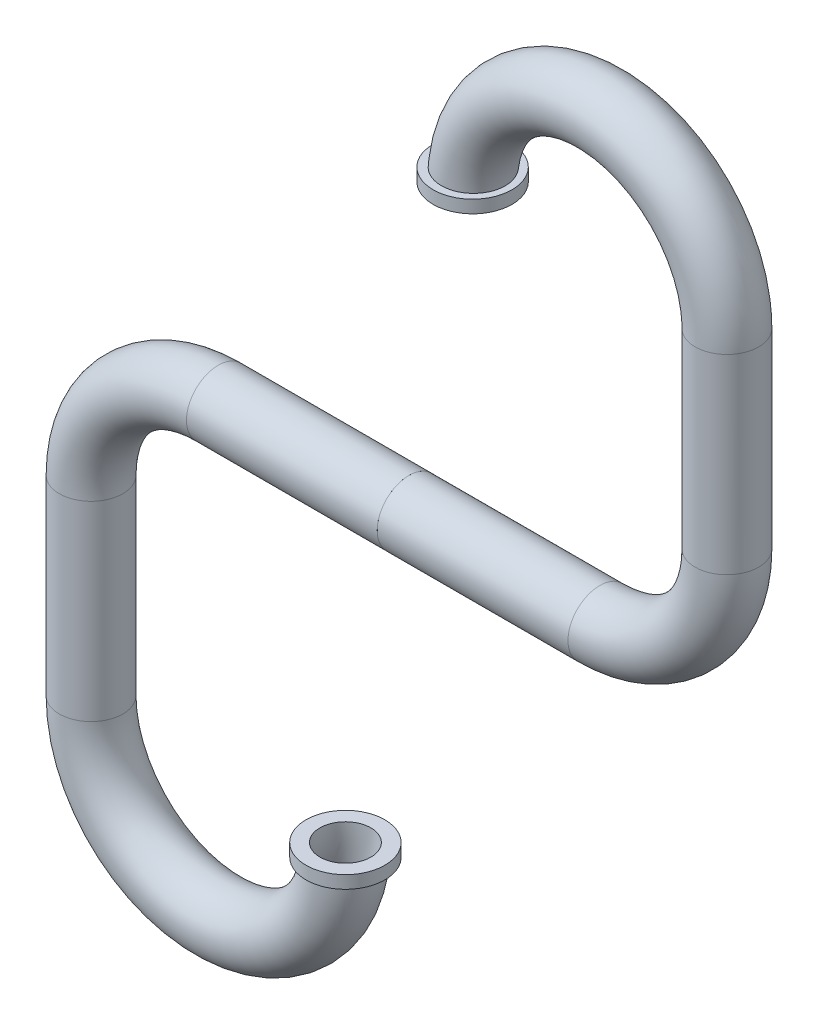
ISO-10303-21;
HEADER;
FILE_DESCRIPTION(('STEP AP214'),'2;1');
FILE_NAME('part.step','',(''),(''),'','','');
FILE_SCHEMA(('AUTOMOTIVE_DESIGN { 1 0 10303 214 1 1 1 1 }'));
ENDSEC;
DATA;
#1=APPLICATION_CONTEXT('core data for automotive mechanical design processes');
#2=APPLICATION_PROTOCOL_DEFINITION('international standard','automotive_design',2000,#1);
#3=PRODUCT_CONTEXT('',#1,'mechanical');
#4=PRODUCT('Part','Part','',(#3));
#5=PRODUCT_RELATED_PRODUCT_CATEGORY('part','',(#4));
#6=PRODUCT_DEFINITION_FORMATION('','',#4);
#7=PRODUCT_DEFINITION_CONTEXT('part definition',#1,'design');
#8=PRODUCT_DEFINITION('design','',#6,#7);
#9=PRODUCT_DEFINITION_SHAPE('','',#8);
#10=(LENGTH_UNIT() NAMED_UNIT(*) SI_UNIT(.MILLI.,.METRE.));
#11=(NAMED_UNIT(*) PLANE_ANGLE_UNIT() SI_UNIT($,.RADIAN.));
#12=(NAMED_UNIT(*) SI_UNIT($,.STERADIAN.) SOLID_ANGLE_UNIT());
#13=UNCERTAINTY_MEASURE_WITH_UNIT(LENGTH_MEASURE(1.E-05),#10,'distance_accuracy_value','');
#14=(GEOMETRIC_REPRESENTATION_CONTEXT(3) GLOBAL_UNCERTAINTY_ASSIGNED_CONTEXT((#13)) GLOBAL_UNIT_ASSIGNED_CONTEXT((#10,
#11,#12)) REPRESENTATION_CONTEXT('',''));
#15=CARTESIAN_POINT('',(0.,0.,0.));
#16=DIRECTION('',(0.,0.,1.));
#17=DIRECTION('',(1.,0.,0.));
#18=AXIS2_PLACEMENT_3D('',#15,#16,#17);
#19=CARTESIAN_POINT('',(0.5,-5.,0.));
#20=DIRECTION('',(1.,0.,0.));
#21=DIRECTION('',(0.,0.,1.));
#22=AXIS2_PLACEMENT_3D('',#19,#20,#21);
#23=PLANE('',#22);
#24=CARTESIAN_POINT('',(0.5,-2.5,0.));
#25=DIRECTION('',(1.,0.,0.));
#26=DIRECTION('',(0.,0.,1.));
#27=AXIS2_PLACEMENT_3D('',#24,#25,#26);
#28=CIRCLE('',#27,0.2);
#29=CARTESIAN_POINT('',(0.5,-2.5,0.2));
#30=VERTEX_POINT('',#29);
#31=EDGE_CURVE('E44',#30,#30,#28,.F.);
#32=ORIENTED_EDGE('',*,*,#31,.T.);
#33=EDGE_LOOP('',(#32));
#34=FACE_BOUND('',#33,.T.);
#35=CARTESIAN_POINT('',(0.5,-2.5,0.));
#36=DIRECTION('',(1.,0.,0.));
#37=DIRECTION('',(0.,0.,1.));
#38=AXIS2_PLACEMENT_3D('',#35,#36,#37);
#39=CIRCLE('',#38,0.25);
#40=CARTESIAN_POINT('',(0.5,-2.5,0.25));
#41=VERTEX_POINT('',#40);
#42=EDGE_CURVE('E58',#41,#41,#39,.F.);
#43=ORIENTED_EDGE('',*,*,#42,.F.);
#44=EDGE_LOOP('',(#43));
#45=FACE_BOUND('',#44,.T.);
#46=ADVANCED_FACE('F40',(#34,#45),#23,.T.);
#47=CARTESIAN_POINT('',(0.,-5.1,0.));
#48=DIRECTION('',(0.,1.,0.));
#49=DIRECTION('',(0.,0.,1.));
#50=AXIS2_PLACEMENT_3D('',#47,#48,#49);
#51=CYLINDRICAL_SURFACE('',#50,0.31);
#52=CARTESIAN_POINT('',(0.,-5.1,0.));
#53=DIRECTION('',(0.,-1.,0.));
#54=DIRECTION('',(0.,0.,-1.));
#55=AXIS2_PLACEMENT_3D('',#52,#53,#54);
#56=CIRCLE('',#55,0.31);
#57=CARTESIAN_POINT('',(0.,-5.1,-0.310000000000018));
#58=VERTEX_POINT('',#57);
#59=EDGE_CURVE('E48',#58,#58,#56,.T.);
#60=ORIENTED_EDGE('',*,*,#59,.F.);
#61=EDGE_LOOP('',(#60));
#62=FACE_BOUND('',#61,.T.);
#63=CARTESIAN_POINT('',(0.,-5.,0.));
#64=DIRECTION('',(0.,-1.,0.));
#65=DIRECTION('',(0.,0.,-1.));
#66=AXIS2_PLACEMENT_3D('',#63,#64,#65);
#67=CIRCLE('',#66,0.31);
#68=CARTESIAN_POINT('',(0.,-5.,-0.310000000000017));
#69=VERTEX_POINT('',#68);
#70=EDGE_CURVE('E11',#69,#69,#67,.T.);
#71=ORIENTED_EDGE('',*,*,#70,.T.);
#72=EDGE_LOOP('',(#71));
#73=FACE_BOUND('',#72,.T.);
#74=ADVANCED_FACE('F84',(#62,#73),#51,.T.);
#75=CARTESIAN_POINT('',(0.,-5.1,0.));
#76=DIRECTION('',(0.,-1.,0.));
#77=DIRECTION('',(0.,0.,-1.));
#78=AXIS2_PLACEMENT_3D('',#75,#76,#77);
#79=PLANE('',#78);
#80=ORIENTED_EDGE('',*,*,#59,.T.);
#81=EDGE_LOOP('',(#80));
#82=FACE_BOUND('',#81,.T.);
#83=CARTESIAN_POINT('',(-0.201401096317609,-5.1,0.156239637939037));
#84=CARTESIAN_POINT('',(-0.210190615714738,-5.1,0.145344468335591));
#85=CARTESIAN_POINT('',(-0.218071722109463,-5.1,0.133703962300563));
#86=CARTESIAN_POINT('',(-0.231777903107573,-5.1,0.10925737914307));
#87=CARTESIAN_POINT('',(-0.237600690405998,-5.1,0.0964500251078168));
#88=CARTESIAN_POINT('',(-0.247007650165607,-5.1,0.0700386597896229));
#89=CARTESIAN_POINT('',(-0.250592194362358,-5.1,0.0564347812071003));
#90=CARTESIAN_POINT('',(-0.255413188399921,-5.1,0.0288206461573174));
#91=CARTESIAN_POINT('',(-0.256650230465359,-5.1,0.0148104930901928));
#92=CARTESIAN_POINT('',(-0.25674012956133,-5.1,-0.0131538110387582));
#93=CARTESIAN_POINT('',(-0.255603761287644,-5.1,-0.0271079282970044));
#94=CARTESIAN_POINT('',(-0.251003172674125,-5.1,-0.0546272137432354));
#95=CARTESIAN_POINT('',(-0.247538882318156,-5.1,-0.068192370219781));
#96=CARTESIAN_POINT('',(-0.238388633745031,-5.1,-0.0945453892648954));
#97=CARTESIAN_POINT('',(-0.232703487129412,-5.1,-0.107333533818303));
#98=CARTESIAN_POINT('',(-0.219279773062284,-5.1,-0.131782096781492));
#99=CARTESIAN_POINT('',(-0.211541147629265,-5.1,-0.143442483335494));
#100=CARTESIAN_POINT('',(-0.194180832606932,-5.1,-0.165383116436998));
#101=CARTESIAN_POINT('',(-0.18454778916345,-5.1,-0.175654378083567));
#102=CARTESIAN_POINT('',(-0.163705864908684,-5.1,-0.194449314988632));
#103=CARTESIAN_POINT('',(-0.152496920871618,-5.1,-0.202972920096682));
#104=CARTESIAN_POINT('',(-0.128727432177818,-5.1,-0.218098495866892));
#105=CARTESIAN_POINT('',(-0.116157110459004,-5.1,-0.22468510480364));
#106=CARTESIAN_POINT('',(-0.0900925582958239,-5.1,-0.235665425768135));
#107=CARTESIAN_POINT('',(-0.0765983014200872,-5.1,-0.240059075031207));
#108=CARTESIAN_POINT('',(-0.0490037254832951,-5.1,-0.24654519119287));
#109=CARTESIAN_POINT('',(-0.0349009697958583,-5.1,-0.248627297728056));
#110=CARTESIAN_POINT('',(-0.00654593496886681,-5.1,-0.250394447161833));
#111=CARTESIAN_POINT('',(0.00770634481024823,-5.1,-0.250079479803226));
#112=CARTESIAN_POINT('',(0.0359552161641338,-5.1,-0.247058139402263));
#113=CARTESIAN_POINT('',(0.0499518104184512,-5.1,-0.244351791435918));
#114=CARTESIAN_POINT('',(0.0772894135497917,-5.1,-0.236620477359473));
#115=CARTESIAN_POINT('',(0.0906304308904238,-5.1,-0.231595541191448));
#116=CARTESIAN_POINT('',(0.116234413487642,-5.1,-0.219384869006463));
#117=CARTESIAN_POINT('',(0.128500521169366,-5.1,-0.212205722852432));
#118=CARTESIAN_POINT('',(0.151646839119026,-5.1,-0.195882113872202));
#119=CARTESIAN_POINT('',(0.162527077997131,-5.1,-0.186737691628057));
#120=CARTESIAN_POINT('',(0.182546180432526,-5.1,-0.166782766405192));
#121=CARTESIAN_POINT('',(0.191691887715395,-5.1,-0.155979129073395));
#122=CARTESIAN_POINT('',(0.208031942604488,-5.1,-0.132985122648459));
#123=CARTESIAN_POINT('',(0.215226328920527,-5.1,-0.12079478107122));
#124=CARTESIAN_POINT('',(0.227433287128235,-5.1,-0.0954202629388221));
#125=CARTESIAN_POINT('',(0.232453530620286,-5.1,-0.0822397766594236));
#126=CARTESIAN_POINT('',(0.240204253167929,-5.1,-0.0552219448415375));
#127=CARTESIAN_POINT('',(0.242934765237328,-5.1,-0.0413846087766815));
#128=CARTESIAN_POINT('',(0.246023480720512,-5.1,-0.0134795739953211));
#129=CARTESIAN_POINT('',(0.246387057425578,-5.1,0.000587530219654979));
#130=CARTESIAN_POINT('',(0.244745727650855,-5.1,0.0285828177191157));
#131=CARTESIAN_POINT('',(0.242740835396257,-5.1,0.0425110018374574));
#132=CARTESIAN_POINT('',(0.236422429745385,-5.1,0.0698241464986179));
#133=CARTESIAN_POINT('',(0.232110367704181,-5.1,0.0832094428634621));
#134=CARTESIAN_POINT('',(0.221302613835047,-5.1,0.109067212165569));
#135=CARTESIAN_POINT('',(0.21480691921559,-5.1,0.121539683935864));
#136=CARTESIAN_POINT('',(0.19980999110781,-5.1,0.145233133026603));
#137=CARTESIAN_POINT('',(0.191306581255811,-5.1,0.156452732655606));
#138=CARTESIAN_POINT('',(0.172541402772618,-5.1,0.177309784421263));
#139=CARTESIAN_POINT('',(0.162279611876264,-5.1,0.186947216521001));
#140=CARTESIAN_POINT('',(0.140260536178512,-5.1,0.204394588974092));
#141=CARTESIAN_POINT('',(0.128499350856914,-5.1,0.212199606378316));
#142=CARTESIAN_POINT('',(0.103837454519992,-5.1,0.225732886882546));
#143=CARTESIAN_POINT('',(0.0909367201277325,-5.1,0.231461107366419));
#144=CARTESIAN_POINT('',(0.0643098227029985,-5.1,0.240701650163371));
#145=CARTESIAN_POINT('',(0.0505807148736025,-5.1,0.244205486570337));
#146=CARTESIAN_POINT('',(0.0227304868784085,-5.1,0.248868281721851));
#147=CARTESIAN_POINT('',(0.00860937300525727,-5.1,0.250027278084723));
#148=CARTESIAN_POINT('',(-0.019682310331464,-5.1,0.249971637934838));
#149=CARTESIAN_POINT('',(-0.033852861838134,-5.1,0.248747884057973));
#150=CARTESIAN_POINT('',(-0.0617929096379455,-5.1,0.243944388235417));
#151=CARTESIAN_POINT('',(-0.0755622983800522,-5.1,0.240364020446158));
#152=CARTESIAN_POINT('',(-0.102345731745449,-5.1,0.23093509708142));
#153=CARTESIAN_POINT('',(-0.115357430686798,-5.1,0.225079887987251));
#154=CARTESIAN_POINT('',(-0.140200186875687,-5.1,0.211269182972982));
#155=CARTESIAN_POINT('',(-0.152032625018917,-5.1,0.203316184310875));
#156=CARTESIAN_POINT('',(-0.170150558895375,-5.1,0.188776882063827));
#157=CARTESIAN_POINT('',(-0.176888616987927,-5.1,0.182745072414746));
#158=CARTESIAN_POINT('',(-0.189677604716015,-5.1,0.169992202553533));
#159=CARTESIAN_POINT('',(-0.195728533355725,-5.1,0.163271141342525));
#160=CARTESIAN_POINT('',(-0.201401096317609,-5.1,0.156239637939037));
#161=B_SPLINE_CURVE_WITH_KNOTS('',3,(#83,#84,#85,#86,#87,#88,#89,#90,#91,#92,#93,#94,#95,#96,
#97,#98,#99,#100,#101,#102,#103,#104,#105,#106,#107,#108,#109,#110,#111,#112,#113,#114,#115,
#116,#117,#118,#119,#120,#121,#122,#123,#124,#125,#126,#127,#128,#129,#130,#131,#132,#133,#134,
#135,#136,#137,#138,#139,#140,#141,#142,#143,#144,#145,#146,#147,#148,#149,#150,#151,#152,#153,
#154,#155,#156,#157,#158,#159,#160),.UNSPECIFIED.,.T.,.F.,(4,2,2,2,2,2,2,2,2,2,2,2,2,2,2,2,2,2,
2,2,2,2,2,2,2,2,2,2,2,2,2,2,2,2,2,2,2,2,4),(0.,0.0419631052503927,0.0839726964411998,
0.125975308668973,0.167967323125762,0.209769118662524,0.251572171514233,0.293359961905662,
0.335148932332196,0.377196440897467,0.419245636907758,0.461619835954524,0.503995247723257,
0.54655982933734,0.589124593087473,0.631688910508933,0.6742526782734,0.716687545691694,
0.759121536933536,0.801384450217337,0.843646525038763,0.88575823574167,0.927869339259047,
0.969884810944664,1.01190003028372,1.05388885042508,1.09587772424463,1.13791232469054,
1.17994745743075,1.22209426111071,1.26424192959939,1.30654943795309,1.34885626756105,
1.39132529833847,1.43380561212635,1.47641112039157,1.51896613717817,1.5460481653165,
1.57313023270311),.UNSPECIFIED.);
#162=CARTESIAN_POINT('',(-0.201401096317609,-5.1,0.156239637939037));
#163=VERTEX_POINT('',#162);
#164=EDGE_CURVE('E53',#163,#163,#161,.T.);
#165=ORIENTED_EDGE('',*,*,#164,.F.);
#166=EDGE_LOOP('',(#165));
#167=FACE_BOUND('',#166,.T.);
#168=ADVANCED_FACE('F86',(#82,#167),#79,.T.);
#169=CARTESIAN_POINT('',(-1.,-5.,0.));
#170=DIRECTION('',(0.,0.,1.));
#171=DIRECTION('',(-1.,0.,0.));
#172=AXIS2_PLACEMENT_3D('',#169,#170,#171);
#173=TOROIDAL_SURFACE('',#172,1.,0.25);
#174=ORIENTED_EDGE('',*,*,#164,.T.);
#175=EDGE_LOOP('',(#174));
#176=FACE_BOUND('',#175,.T.);
#177=CARTESIAN_POINT('',(-2.,-5.,0.));
#178=DIRECTION('',(0.,1.,0.));
#179=DIRECTION('',(1.,0.,0.));
#180=AXIS2_PLACEMENT_3D('',#177,#178,#179);
#181=CIRCLE('',#180,0.25);
#182=CARTESIAN_POINT('',(-1.75,-5.,0.));
#183=VERTEX_POINT('',#182);
#184=EDGE_CURVE('E109',#183,#183,#181,.T.);
#185=ORIENTED_EDGE('',*,*,#184,.F.);
#186=EDGE_LOOP('',(#185));
#187=FACE_BOUND('',#186,.T.);
#188=ADVANCED_FACE('F93',(#176,#187),#173,.T.);
#189=CARTESIAN_POINT('',(-2.,-5.,0.));
#190=DIRECTION('',(0.,1.,0.));
#191=DIRECTION('',(1.,0.,0.));
#192=AXIS2_PLACEMENT_3D('',#189,#190,#191);
#193=CYLINDRICAL_SURFACE('',#192,0.25);
#194=ORIENTED_EDGE('',*,*,#184,.T.);
#195=EDGE_LOOP('',(#194));
#196=FACE_BOUND('',#195,.T.);
#197=CARTESIAN_POINT('',(-2.,-3.5,0.));
#198=DIRECTION('',(0.,-1.,0.));
#199=DIRECTION('',(-1.,0.,0.));
#200=AXIS2_PLACEMENT_3D('',#197,#198,#199);
#201=CIRCLE('',#200,0.25);
#202=CARTESIAN_POINT('',(-2.25,-3.5,0.));
#203=VERTEX_POINT('',#202);
#204=EDGE_CURVE('E64',#203,#203,#201,.F.);
#205=ORIENTED_EDGE('',*,*,#204,.F.);
#206=EDGE_LOOP('',(#205));
#207=FACE_BOUND('',#206,.T.);
#208=ADVANCED_FACE('F114',(#196,#207),#193,.T.);
#209=CARTESIAN_POINT('',(-1.,-3.5,0.));
#210=DIRECTION('',(0.,0.,-1.));
#211=DIRECTION('',(1.,0.,0.));
#212=AXIS2_PLACEMENT_3D('',#209,#210,#211);
#213=TOROIDAL_SURFACE('',#212,1.,0.25);
#214=CARTESIAN_POINT('',(-1.,-2.5,0.));
#215=DIRECTION('',(1.,0.,0.));
#216=DIRECTION('',(0.,-1.,0.));
#217=AXIS2_PLACEMENT_3D('',#214,#215,#216);
#218=CIRCLE('',#217,0.25);
#219=CARTESIAN_POINT('',(-1.,-2.25,0.));
#220=VERTEX_POINT('',#219);
#221=EDGE_CURVE('E60',#220,#220,#218,.T.);
#222=CARTESIAN_POINT('',(-1.,-3.5,0.));
#223=DIRECTION('',(0.,0.,-1.));
#224=DIRECTION('',(1.,0.,0.));
#225=AXIS2_PLACEMENT_3D('',#222,#223,#224);
#226=CIRCLE('',#225,1.25);
#227=EDGE_CURVE('',#203,#220,#226,.T.);
#228=ORIENTED_EDGE('',*,*,#204,.T.);
#229=ORIENTED_EDGE('',*,*,#221,.F.);
#230=ORIENTED_EDGE('',*,*,#227,.T.);
#231=ORIENTED_EDGE('',*,*,#227,.F.);
#232=EDGE_LOOP('',(#228,#230,#229,#231));
#233=FACE_BOUND('',#232,.T.);
#234=ADVANCED_FACE('F118',(#233),#213,.T.);
#235=CARTESIAN_POINT('',(0.,-5.,0.));
#236=DIRECTION('',(0.,-1.,0.));
#237=DIRECTION('',(0.,0.,-1.));
#238=AXIS2_PLACEMENT_3D('',#235,#236,#237);
#239=PLANE('',#238);
#240=CARTESIAN_POINT('',(0.,-5.,0.));
#241=DIRECTION('',(0.,-1.,0.));
#242=DIRECTION('',(0.,0.,-1.));
#243=AXIS2_PLACEMENT_3D('',#240,#241,#242);
#244=CIRCLE('',#243,0.2);
#245=CARTESIAN_POINT('',(0.2,-5.,0.));
#246=VERTEX_POINT('',#245);
#247=EDGE_CURVE('E56',#246,#246,#244,.T.);
#248=ORIENTED_EDGE('',*,*,#247,.T.);
#249=EDGE_LOOP('',(#248));
#250=FACE_BOUND('',#249,.T.);
#251=ORIENTED_EDGE('',*,*,#70,.F.);
#252=EDGE_LOOP('',(#251));
#253=FACE_BOUND('',#252,.T.);
#254=ADVANCED_FACE('F122',(#250,#253),#239,.F.);
#255=CARTESIAN_POINT('',(-1.,-5.,0.));
#256=DIRECTION('',(0.,0.,1.));
#257=DIRECTION('',(-1.,0.,0.));
#258=AXIS2_PLACEMENT_3D('',#255,#256,#257);
#259=TOROIDAL_SURFACE('',#258,1.,0.2);
#260=CARTESIAN_POINT('',(-2.,-5.,0.));
#261=DIRECTION('',(0.,1.,0.));
#262=DIRECTION('',(0.,0.,-1.));
#263=AXIS2_PLACEMENT_3D('',#260,#261,#262);
#264=CIRCLE('',#263,0.2);
#265=CARTESIAN_POINT('',(-2.2,-5.,0.));
#266=VERTEX_POINT('',#265);
#267=EDGE_CURVE('E135',#266,#266,#264,.T.);
#268=CARTESIAN_POINT('',(-1.,-5.,0.));
#269=DIRECTION('',(0.,0.,1.));
#270=DIRECTION('',(-1.,0.,0.));
#271=AXIS2_PLACEMENT_3D('',#268,#269,#270);
#272=CIRCLE('',#271,1.2);
#273=EDGE_CURVE('',#266,#246,#272,.T.);
#274=ORIENTED_EDGE('',*,*,#267,.T.);
#275=ORIENTED_EDGE('',*,*,#247,.F.);
#276=ORIENTED_EDGE('',*,*,#273,.T.);
#277=ORIENTED_EDGE('',*,*,#273,.F.);
#278=EDGE_LOOP('',(#274,#276,#275,#277));
#279=FACE_BOUND('',#278,.T.);
#280=ADVANCED_FACE('F100',(#279),#259,.F.);
#281=CARTESIAN_POINT('',(-2.,-5.,0.));
#282=DIRECTION('',(0.,1.,0.));
#283=DIRECTION('',(1.,0.,0.));
#284=AXIS2_PLACEMENT_3D('',#281,#282,#283);
#285=CYLINDRICAL_SURFACE('',#284,0.2);
#286=ORIENTED_EDGE('',*,*,#267,.F.);
#287=EDGE_LOOP('',(#286));
#288=FACE_BOUND('',#287,.T.);
#289=CARTESIAN_POINT('',(-2.,-3.5,0.));
#290=DIRECTION('',(0.,1.,0.));
#291=DIRECTION('',(0.,0.,-1.));
#292=AXIS2_PLACEMENT_3D('',#289,#290,#291);
#293=CIRCLE('',#292,0.2);
#294=CARTESIAN_POINT('',(-2.2,-3.5,0.));
#295=VERTEX_POINT('',#294);
#296=EDGE_CURVE('E138',#295,#295,#293,.T.);
#297=ORIENTED_EDGE('',*,*,#296,.T.);
#298=EDGE_LOOP('',(#297));
#299=FACE_BOUND('',#298,.T.);
#300=ADVANCED_FACE('F80',(#288,#299),#285,.F.);
#301=CARTESIAN_POINT('',(-1.,-3.5,0.));
#302=DIRECTION('',(0.,0.,-1.));
#303=DIRECTION('',(1.,0.,0.));
#304=AXIS2_PLACEMENT_3D('',#301,#302,#303);
#305=TOROIDAL_SURFACE('',#304,1.,0.2);
#306=CARTESIAN_POINT('',(-1.,-2.5,0.));
#307=DIRECTION('',(1.,0.,0.));
#308=DIRECTION('',(0.,0.,-1.));
#309=AXIS2_PLACEMENT_3D('',#306,#307,#308);
#310=CIRCLE('',#309,0.2);
#311=CARTESIAN_POINT('',(-1.,-2.3,0.));
#312=VERTEX_POINT('',#311);
#313=EDGE_CURVE('E139',#312,#312,#310,.T.);
#314=CARTESIAN_POINT('',(-1.,-3.5,0.));
#315=DIRECTION('',(0.,0.,-1.));
#316=DIRECTION('',(1.,0.,0.));
#317=AXIS2_PLACEMENT_3D('',#314,#315,#316);
#318=CIRCLE('',#317,1.2);
#319=EDGE_CURVE('',#295,#312,#318,.T.);
#320=ORIENTED_EDGE('',*,*,#296,.F.);
#321=ORIENTED_EDGE('',*,*,#313,.T.);
#322=ORIENTED_EDGE('',*,*,#319,.T.);
#323=ORIENTED_EDGE('',*,*,#319,.F.);
#324=EDGE_LOOP('',(#320,#322,#321,#323));
#325=FACE_BOUND('',#324,.T.);
#326=ADVANCED_FACE('F73',(#325),#305,.F.);
#327=CARTESIAN_POINT('',(-1.,-2.5,0.));
#328=DIRECTION('',(1.,0.,0.));
#329=DIRECTION('',(0.,-1.,0.));
#330=AXIS2_PLACEMENT_3D('',#327,#328,#329);
#331=CYLINDRICAL_SURFACE('',#330,0.2);
#332=ORIENTED_EDGE('',*,*,#313,.F.);
#333=EDGE_LOOP('',(#332));
#334=FACE_BOUND('',#333,.T.);
#335=ORIENTED_EDGE('',*,*,#31,.F.);
#336=EDGE_LOOP('',(#335));
#337=FACE_BOUND('',#336,.T.);
#338=ADVANCED_FACE('F42',(#334,#337),#331,.F.);
#339=CARTESIAN_POINT('',(-1.,-2.5,0.));
#340=DIRECTION('',(1.,0.,0.));
#341=DIRECTION('',(0.,-1.,0.));
#342=AXIS2_PLACEMENT_3D('',#339,#340,#341);
#343=CYLINDRICAL_SURFACE('',#342,0.25);
#344=ORIENTED_EDGE('',*,*,#221,.T.);
#345=EDGE_LOOP('',(#344));
#346=FACE_BOUND('',#345,.T.);
#347=ORIENTED_EDGE('',*,*,#42,.T.);
#348=EDGE_LOOP('',(#347));
#349=FACE_BOUND('',#348,.T.);
#350=ADVANCED_FACE('F72',(#346,#349),#343,.T.);
#351=CLOSED_SHELL('',(#46,#74,#168,#188,#208,#234,#254,#280,#300,#326,#338,#350));
#352=MANIFOLD_SOLID_BREP('B2',#351);
#353=CARTESIAN_POINT('',(0.5,0.,0.));
#354=DIRECTION('',(1.,0.,0.));
#355=DIRECTION('',(0.,0.,-1.));
#356=AXIS2_PLACEMENT_3D('',#353,#354,#355);
#357=PLANE('',#356);
#358=CARTESIAN_POINT('',(0.5,-2.5,0.));
#359=DIRECTION('',(1.,0.,0.));
#360=DIRECTION('',(0.,0.,-1.));
#361=AXIS2_PLACEMENT_3D('',#358,#359,#360);
#362=CIRCLE('',#361,0.25);
#363=CARTESIAN_POINT('',(0.5,-2.5,-0.25));
#364=VERTEX_POINT('',#363);
#365=EDGE_CURVE('E39',#364,#364,#362,.F.);
#366=ORIENTED_EDGE('',*,*,#365,.T.);
#367=EDGE_LOOP('',(#366));
#368=FACE_BOUND('',#367,.T.);
#369=CARTESIAN_POINT('',(0.5,-2.5,0.));
#370=DIRECTION('',(1.,0.,0.));
#371=DIRECTION('',(0.,0.,-1.));
#372=AXIS2_PLACEMENT_3D('',#369,#370,#371);
#373=CIRCLE('',#372,0.2);
#374=CARTESIAN_POINT('',(0.5,-2.5,-0.2));
#375=VERTEX_POINT('',#374);
#376=EDGE_CURVE('E240',#375,#375,#373,.F.);
#377=ORIENTED_EDGE('',*,*,#376,.F.);
#378=EDGE_LOOP('',(#377));
#379=FACE_BOUND('',#378,.T.);
#380=ADVANCED_FACE('F234',(#368,#379),#357,.F.);
#381=CARTESIAN_POINT('',(-1.,-2.5,0.));
#382=DIRECTION('',(1.,0.,0.));
#383=DIRECTION('',(0.,1.,0.));
#384=AXIS2_PLACEMENT_3D('',#381,#382,#383);
#385=CYLINDRICAL_SURFACE('',#384,0.25);
#386=ORIENTED_EDGE('',*,*,#365,.F.);
#387=EDGE_LOOP('',(#386));
#388=FACE_BOUND('',#387,.T.);
#389=CARTESIAN_POINT('',(2.,-2.5,0.));
#390=DIRECTION('',(1.,0.,0.));
#391=DIRECTION('',(0.,1.,0.));
#392=AXIS2_PLACEMENT_3D('',#389,#390,#391);
#393=CIRCLE('',#392,0.25);
#394=CARTESIAN_POINT('',(2.,-2.75,0.));
#395=VERTEX_POINT('',#394);
#396=EDGE_CURVE('E244',#395,#395,#393,.T.);
#397=ORIENTED_EDGE('',*,*,#396,.F.);
#398=EDGE_LOOP('',(#397));
#399=FACE_BOUND('',#398,.T.);
#400=ADVANCED_FACE('F277',(#388,#399),#385,.T.);
#401=CARTESIAN_POINT('',(1.,0.,0.));
#402=DIRECTION('',(0.,1.,0.));
#403=DIRECTION('',(0.,0.,1.));
#404=AXIS2_PLACEMENT_3D('',#401,#402,#403);
#405=PLANE('',#404);
#406=CARTESIAN_POINT('',(1.,0.,0.));
#407=DIRECTION('',(0.,-1.,0.));
#408=DIRECTION('',(0.,0.,1.));
#409=AXIS2_PLACEMENT_3D('',#406,#407,#408);
#410=CIRCLE('',#409,0.2);
#411=CARTESIAN_POINT('',(0.800000000000001,0.,0.));
#412=VERTEX_POINT('',#411);
#413=EDGE_CURVE('E258',#412,#412,#410,.T.);
#414=ORIENTED_EDGE('',*,*,#413,.F.);
#415=EDGE_LOOP('',(#414));
#416=FACE_BOUND('',#415,.T.);
#417=CARTESIAN_POINT('',(1.,0.,0.));
#418=DIRECTION('',(0.,-1.,0.));
#419=DIRECTION('',(0.,0.,1.));
#420=AXIS2_PLACEMENT_3D('',#417,#418,#419);
#421=CIRCLE('',#420,0.31);
#422=CARTESIAN_POINT('',(1.,0.,0.31));
#423=VERTEX_POINT('',#422);
#424=EDGE_CURVE('E321',#423,#423,#421,.T.);
#425=ORIENTED_EDGE('',*,*,#424,.T.);
#426=EDGE_LOOP('',(#425));
#427=FACE_BOUND('',#426,.T.);
#428=ADVANCED_FACE('F279',(#416,#427),#405,.F.);
#429=CARTESIAN_POINT('',(2.,0.,0.));
#430=DIRECTION('',(0.,0.,-1.));
#431=DIRECTION('',(1.,0.,0.));
#432=AXIS2_PLACEMENT_3D('',#429,#430,#431);
#433=TOROIDAL_SURFACE('',#432,1.,0.2);
#434=CARTESIAN_POINT('',(3.,0.,0.));
#435=DIRECTION('',(0.,1.,0.));
#436=DIRECTION('',(0.,0.,1.));
#437=AXIS2_PLACEMENT_3D('',#434,#435,#436);
#438=CIRCLE('',#437,0.2);
#439=CARTESIAN_POINT('',(3.2,0.,0.));
#440=VERTEX_POINT('',#439);
#441=EDGE_CURVE('E328',#440,#440,#438,.T.);
#442=CARTESIAN_POINT('',(2.,0.,0.));
#443=DIRECTION('',(0.,0.,-1.));
#444=DIRECTION('',(1.,0.,0.));
#445=AXIS2_PLACEMENT_3D('',#442,#443,#444);
#446=CIRCLE('',#445,1.2);
#447=EDGE_CURVE('',#412,#440,#446,.T.);
#448=ORIENTED_EDGE('',*,*,#413,.T.);
#449=ORIENTED_EDGE('',*,*,#441,.F.);
#450=ORIENTED_EDGE('',*,*,#447,.T.);
#451=ORIENTED_EDGE('',*,*,#447,.F.);
#452=EDGE_LOOP('',(#448,#450,#449,#451));
#453=FACE_BOUND('',#452,.T.);
#454=ADVANCED_FACE('F286',(#453),#433,.F.);
#455=CARTESIAN_POINT('',(3.,0.,0.));
#456=DIRECTION('',(0.,-1.,0.));
#457=DIRECTION('',(-1.,0.,0.));
#458=AXIS2_PLACEMENT_3D('',#455,#456,#457);
#459=CYLINDRICAL_SURFACE('',#458,0.2);
#460=ORIENTED_EDGE('',*,*,#441,.T.);
#461=EDGE_LOOP('',(#460));
#462=FACE_BOUND('',#461,.T.);
#463=CARTESIAN_POINT('',(3.,-1.5,0.));
#464=DIRECTION('',(0.,1.,0.));
#465=DIRECTION('',(0.,0.,1.));
#466=AXIS2_PLACEMENT_3D('',#463,#464,#465);
#467=CIRCLE('',#466,0.2);
#468=CARTESIAN_POINT('',(3.2,-1.5,0.));
#469=VERTEX_POINT('',#468);
#470=EDGE_CURVE('E331',#469,#469,#467,.T.);
#471=ORIENTED_EDGE('',*,*,#470,.F.);
#472=EDGE_LOOP('',(#471));
#473=FACE_BOUND('',#472,.T.);
#474=ADVANCED_FACE('F302',(#462,#473),#459,.F.);
#475=CARTESIAN_POINT('',(2.,-1.5,0.));
#476=DIRECTION('',(0.,0.,1.));
#477=DIRECTION('',(-1.,0.,0.));
#478=AXIS2_PLACEMENT_3D('',#475,#476,#477);
#479=TOROIDAL_SURFACE('',#478,1.,0.2);
#480=CARTESIAN_POINT('',(2.,-2.5,0.));
#481=DIRECTION('',(1.,0.,0.));
#482=DIRECTION('',(0.,0.,1.));
#483=AXIS2_PLACEMENT_3D('',#480,#481,#482);
#484=CIRCLE('',#483,0.2);
#485=CARTESIAN_POINT('',(2.,-2.7,0.));
#486=VERTEX_POINT('',#485);
#487=EDGE_CURVE('E334',#486,#486,#484,.T.);
#488=CARTESIAN_POINT('',(2.,-1.5,0.));
#489=DIRECTION('',(0.,0.,1.));
#490=DIRECTION('',(-1.,0.,0.));
#491=AXIS2_PLACEMENT_3D('',#488,#489,#490);
#492=CIRCLE('',#491,1.2);
#493=EDGE_CURVE('',#486,#469,#492,.T.);
#494=ORIENTED_EDGE('',*,*,#487,.F.);
#495=ORIENTED_EDGE('',*,*,#470,.T.);
#496=ORIENTED_EDGE('',*,*,#493,.T.);
#497=ORIENTED_EDGE('',*,*,#493,.F.);
#498=EDGE_LOOP('',(#494,#496,#495,#497));
#499=FACE_BOUND('',#498,.T.);
#500=ADVANCED_FACE('F276',(#499),#479,.F.);
#501=CARTESIAN_POINT('',(-1.,-2.5,0.));
#502=DIRECTION('',(1.,0.,0.));
#503=DIRECTION('',(0.,1.,0.));
#504=AXIS2_PLACEMENT_3D('',#501,#502,#503);
#505=CYLINDRICAL_SURFACE('',#504,0.2);
#506=ORIENTED_EDGE('',*,*,#376,.T.);
#507=EDGE_LOOP('',(#506));
#508=FACE_BOUND('',#507,.T.);
#509=ORIENTED_EDGE('',*,*,#487,.T.);
#510=EDGE_LOOP('',(#509));
#511=FACE_BOUND('',#510,.T.);
#512=ADVANCED_FACE('F273',(#508,#511),#505,.F.);
#513=CARTESIAN_POINT('',(1.,0.0999999999999996,0.));
#514=DIRECTION('',(0.,-1.,0.));
#515=DIRECTION('',(0.,0.,-1.));
#516=AXIS2_PLACEMENT_3D('',#513,#514,#515);
#517=CYLINDRICAL_SURFACE('',#516,0.31);
#518=CARTESIAN_POINT('',(1.,0.0999999999999996,0.));
#519=DIRECTION('',(0.,-1.,0.));
#520=DIRECTION('',(0.,0.,1.));
#521=AXIS2_PLACEMENT_3D('',#518,#519,#520);
#522=CIRCLE('',#521,0.31);
#523=CARTESIAN_POINT('',(1.,0.0999999999999996,0.31));
#524=VERTEX_POINT('',#523);
#525=EDGE_CURVE('E259',#524,#524,#522,.T.);
#526=ORIENTED_EDGE('',*,*,#525,.T.);
#527=EDGE_LOOP('',(#526));
#528=FACE_BOUND('',#527,.T.);
#529=ORIENTED_EDGE('',*,*,#424,.F.);
#530=EDGE_LOOP('',(#529));
#531=FACE_BOUND('',#530,.T.);
#532=ADVANCED_FACE('F275',(#528,#531),#517,.T.);
#533=CARTESIAN_POINT('',(1.,0.0999999999999996,0.));
#534=DIRECTION('',(0.,1.,0.));
#535=DIRECTION('',(0.,0.,1.));
#536=AXIS2_PLACEMENT_3D('',#533,#534,#535);
#537=PLANE('',#536);
#538=ORIENTED_EDGE('',*,*,#525,.F.);
#539=EDGE_LOOP('',(#538));
#540=FACE_BOUND('',#539,.T.);
#541=CARTESIAN_POINT('',(1.20140109631761,0.0999999999999994,-0.156239637939055));
#542=CARTESIAN_POINT('',(1.21019061571474,0.0999999999999994,-0.145344468335609));
#543=CARTESIAN_POINT('',(1.21807172210946,0.0999999999999994,-0.133703962300581));
#544=CARTESIAN_POINT('',(1.23177790310757,0.0999999999999994,-0.109257379143088));
#545=CARTESIAN_POINT('',(1.237600690406,0.0999999999999994,-0.096450025107835));
#546=CARTESIAN_POINT('',(1.24700765016561,0.0999999999999994,-0.0700386597896411));
#547=CARTESIAN_POINT('',(1.25059219436236,0.0999999999999994,-0.0564347812071185));
#548=CARTESIAN_POINT('',(1.25541318839992,0.0999999999999994,-0.0288206461573356));
#549=CARTESIAN_POINT('',(1.25665023046536,0.0999999999999994,-0.014810493090211));
#550=CARTESIAN_POINT('',(1.25674012956133,0.0999999999999994,0.0131538110387401));
#551=CARTESIAN_POINT('',(1.25560376128764,0.0999999999999994,0.0271079282969863));
#552=CARTESIAN_POINT('',(1.25100317267413,0.0999999999999994,0.0546272137432173));
#553=CARTESIAN_POINT('',(1.24753888231816,0.0999999999999994,0.0681923702197628));
#554=CARTESIAN_POINT('',(1.23838863374503,0.0999999999999994,0.0945453892648773));
#555=CARTESIAN_POINT('',(1.23270348712941,0.0999999999999994,0.107333533818285));
#556=CARTESIAN_POINT('',(1.21927977306228,0.0999999999999994,0.131782096781474));
#557=CARTESIAN_POINT('',(1.21154114762927,0.0999999999999994,0.143442483335476));
#558=CARTESIAN_POINT('',(1.19418083260693,0.0999999999999995,0.16538311643698));
#559=CARTESIAN_POINT('',(1.18454778916345,0.0999999999999995,0.175654378083549));
#560=CARTESIAN_POINT('',(1.16370586490868,0.0999999999999995,0.194449314988614));
#561=CARTESIAN_POINT('',(1.15249692087162,0.0999999999999995,0.202972920096664));
#562=CARTESIAN_POINT('',(1.12872743217782,0.0999999999999995,0.218098495866874));
#563=CARTESIAN_POINT('',(1.11615711045901,0.0999999999999995,0.224685104803622));
#564=CARTESIAN_POINT('',(1.09009255829582,0.0999999999999995,0.235665425768117));
#565=CARTESIAN_POINT('',(1.07659830142009,0.0999999999999995,0.240059075031189));
#566=CARTESIAN_POINT('',(1.0490037254833,0.0999999999999996,0.246545191192852));
#567=CARTESIAN_POINT('',(1.03490096979586,0.0999999999999996,0.248627297728038));
#568=CARTESIAN_POINT('',(1.00654593496887,0.0999999999999996,0.250394447161815));
#569=CARTESIAN_POINT('',(0.992293655189753,0.0999999999999996,0.250079479803207));
#570=CARTESIAN_POINT('',(0.964044783835867,0.0999999999999996,0.247058139402245));
#571=CARTESIAN_POINT('',(0.95004818958155,0.0999999999999996,0.244351791435899));
#572=CARTESIAN_POINT('',(0.922710586450209,0.0999999999999997,0.236620477359455));
#573=CARTESIAN_POINT('',(0.909369569109577,0.0999999999999997,0.23159554119143));
#574=CARTESIAN_POINT('',(0.883765586512359,0.0999999999999997,0.219384869006445));
#575=CARTESIAN_POINT('',(0.871499478830634,0.0999999999999997,0.212205722852414));
#576=CARTESIAN_POINT('',(0.848353160880975,0.0999999999999997,0.195882113872184));
#577=CARTESIAN_POINT('',(0.837472922002869,0.0999999999999997,0.186737691628039));
#578=CARTESIAN_POINT('',(0.817453819567474,0.0999999999999997,0.166782766405174));
#579=CARTESIAN_POINT('',(0.808308112284606,0.0999999999999997,0.155979129073377));
#580=CARTESIAN_POINT('',(0.791968057395513,0.0999999999999998,0.132985122648441));
#581=CARTESIAN_POINT('',(0.784773671079474,0.0999999999999998,0.120794781071202));
#582=CARTESIAN_POINT('',(0.772566712871766,0.0999999999999998,0.095420262938804));
#583=CARTESIAN_POINT('',(0.767546469379715,0.0999999999999998,0.0822397766594054));
#584=CARTESIAN_POINT('',(0.759795746832072,0.0999999999999998,0.0552219448415193));
#585=CARTESIAN_POINT('',(0.757065234762672,0.0999999999999998,0.0413846087766634));
#586=CARTESIAN_POINT('',(0.753976519279488,0.0999999999999998,0.013479573995303));
#587=CARTESIAN_POINT('',(0.753612942574423,0.0999999999999998,-0.000587530219673126));
#588=CARTESIAN_POINT('',(0.755254272349145,0.0999999999999998,-0.0285828177191339));
#589=CARTESIAN_POINT('',(0.757259164603744,0.0999999999999998,-0.0425110018374756));
#590=CARTESIAN_POINT('',(0.763577570254616,0.0999999999999998,-0.069824146498636));
#591=CARTESIAN_POINT('',(0.76788963229582,0.0999999999999998,-0.0832094428634802));
#592=CARTESIAN_POINT('',(0.778697386164953,0.0999999999999998,-0.109067212165587));
#593=CARTESIAN_POINT('',(0.785193080784411,0.0999999999999998,-0.121539683935882));
#594=CARTESIAN_POINT('',(0.800190008892191,0.0999999999999997,-0.145233133026621));
#595=CARTESIAN_POINT('',(0.808693418744189,0.0999999999999997,-0.156452732655624));
#596=CARTESIAN_POINT('',(0.827458597227383,0.0999999999999997,-0.177309784421281));
#597=CARTESIAN_POINT('',(0.837720388123736,0.0999999999999997,-0.18694721652102));
#598=CARTESIAN_POINT('',(0.859739463821489,0.0999999999999997,-0.20439458897411));
#599=CARTESIAN_POINT('',(0.871500649143087,0.0999999999999997,-0.212199606378334));
#600=CARTESIAN_POINT('',(0.896162545480009,0.0999999999999997,-0.225732886882564));
#601=CARTESIAN_POINT('',(0.909063279872268,0.0999999999999997,-0.231461107366438));
#602=CARTESIAN_POINT('',(0.935690177297002,0.0999999999999997,-0.240701650163389));
#603=CARTESIAN_POINT('',(0.949419285126398,0.0999999999999996,-0.244205486570355));
#604=CARTESIAN_POINT('',(0.977269513121592,0.0999999999999996,-0.248868281721869));
#605=CARTESIAN_POINT('',(0.991390626994743,0.0999999999999996,-0.250027278084741));
#606=CARTESIAN_POINT('',(1.01968231033146,0.0999999999999996,-0.249971637934856));
#607=CARTESIAN_POINT('',(1.03385286183813,0.0999999999999996,-0.248747884057992));
#608=CARTESIAN_POINT('',(1.06179290963795,0.0999999999999995,-0.243944388235435));
#609=CARTESIAN_POINT('',(1.07556229838005,0.0999999999999995,-0.240364020446176));
#610=CARTESIAN_POINT('',(1.10234573174545,0.0999999999999995,-0.230935097081438));
#611=CARTESIAN_POINT('',(1.1153574306868,0.0999999999999995,-0.225079887987269));
#612=CARTESIAN_POINT('',(1.14020018687569,0.0999999999999995,-0.211269182973001));
#613=CARTESIAN_POINT('',(1.15203262501892,0.0999999999999995,-0.203316184310893));
#614=CARTESIAN_POINT('',(1.17015055889538,0.0999999999999995,-0.188776882063845));
#615=CARTESIAN_POINT('',(1.17688861698793,0.0999999999999995,-0.182745072414765));
#616=CARTESIAN_POINT('',(1.18967760471602,0.0999999999999995,-0.169992202553551));
#617=CARTESIAN_POINT('',(1.19572853335573,0.0999999999999994,-0.163271141342544));
#618=CARTESIAN_POINT('',(1.20140109631761,0.0999999999999994,-0.156239637939055));
#619=B_SPLINE_CURVE_WITH_KNOTS('',3,(#541,#542,#543,#544,#545,#546,#547,#548,#549,#550,#551,
#552,#553,#554,#555,#556,#557,#558,#559,#560,#561,#562,#563,#564,#565,#566,#567,#568,#569,#570,
#571,#572,#573,#574,#575,#576,#577,#578,#579,#580,#581,#582,#583,#584,#585,#586,#587,#588,#589,
#590,#591,#592,#593,#594,#595,#596,#597,#598,#599,#600,#601,#602,#603,#604,#605,#606,#607,#608,
#609,#610,#611,#612,#613,#614,#615,#616,#617,#618),.UNSPECIFIED.,.T.,.F.,(4,2,2,2,2,2,2,2,2,2,2,
2,2,2,2,2,2,2,2,2,2,2,2,2,2,2,2,2,2,2,2,2,2,2,2,2,2,2,4),(0.,0.0419631052503928,
0.0839726964411998,0.125975308668973,0.167967323125762,0.209769118662524,0.251572171514233,
0.293359961905662,0.335148932332196,0.377196440897467,0.419245636907758,0.461619835954524,
0.503995247723258,0.54655982933734,0.589124593087474,0.631688910508933,0.6742526782734,
0.716687545691694,0.759121536933536,0.801384450217337,0.843646525038764,0.88575823574167,
0.927869339259047,0.969884810944665,1.01190003028372,1.05388885042508,1.09587772424463,
1.13791232469054,1.17994745743075,1.22209426111071,1.26424192959939,1.30654943795309,
1.34885626756105,1.39132529833847,1.43380561212635,1.47641112039157,1.51896613717817,
1.5460481653165,1.57313023270311),.UNSPECIFIED.);
#620=CARTESIAN_POINT('',(1.20140109631761,0.0999999999999994,-0.156239637939055));
#621=VERTEX_POINT('',#620);
#622=EDGE_CURVE('E251',#621,#621,#619,.T.);
#623=ORIENTED_EDGE('',*,*,#622,.T.);
#624=EDGE_LOOP('',(#623));
#625=FACE_BOUND('',#624,.T.);
#626=ADVANCED_FACE('F262',(#540,#625),#537,.T.);
#627=CARTESIAN_POINT('',(2.,0.,0.));
#628=DIRECTION('',(0.,0.,-1.));
#629=DIRECTION('',(1.,0.,0.));
#630=AXIS2_PLACEMENT_3D('',#627,#628,#629);
#631=TOROIDAL_SURFACE('',#630,1.,0.25);
#632=ORIENTED_EDGE('',*,*,#622,.F.);
#633=EDGE_LOOP('',(#632));
#634=FACE_BOUND('',#633,.T.);
#635=CARTESIAN_POINT('',(3.,0.,0.));
#636=DIRECTION('',(0.,1.,0.));
#637=DIRECTION('',(-1.,0.,0.));
#638=AXIS2_PLACEMENT_3D('',#635,#636,#637);
#639=CIRCLE('',#638,0.25);
#640=CARTESIAN_POINT('',(2.75,0.,0.));
#641=VERTEX_POINT('',#640);
#642=EDGE_CURVE('E260',#641,#641,#639,.T.);
#643=ORIENTED_EDGE('',*,*,#642,.T.);
#644=EDGE_LOOP('',(#643));
#645=FACE_BOUND('',#644,.T.);
#646=ADVANCED_FACE('F265',(#634,#645),#631,.T.);
#647=CARTESIAN_POINT('',(3.,0.,0.));
#648=DIRECTION('',(0.,-1.,0.));
#649=DIRECTION('',(-1.,0.,0.));
#650=AXIS2_PLACEMENT_3D('',#647,#648,#649);
#651=CYLINDRICAL_SURFACE('',#650,0.25);
#652=ORIENTED_EDGE('',*,*,#642,.F.);
#653=EDGE_LOOP('',(#652));
#654=FACE_BOUND('',#653,.T.);
#655=CARTESIAN_POINT('',(3.,-1.5,0.));
#656=DIRECTION('',(0.,-1.,0.));
#657=DIRECTION('',(1.,0.,0.));
#658=AXIS2_PLACEMENT_3D('',#655,#656,#657);
#659=CIRCLE('',#658,0.25);
#660=CARTESIAN_POINT('',(3.25,-1.5,0.));
#661=VERTEX_POINT('',#660);
#662=EDGE_CURVE('E248',#661,#661,#659,.F.);
#663=ORIENTED_EDGE('',*,*,#662,.T.);
#664=EDGE_LOOP('',(#663));
#665=FACE_BOUND('',#664,.T.);
#666=ADVANCED_FACE('F270',(#654,#665),#651,.T.);
#667=CARTESIAN_POINT('',(2.,-1.5,0.));
#668=DIRECTION('',(0.,0.,1.));
#669=DIRECTION('',(-1.,0.,0.));
#670=AXIS2_PLACEMENT_3D('',#667,#668,#669);
#671=TOROIDAL_SURFACE('',#670,1.,0.25);
#672=CARTESIAN_POINT('',(2.,-1.5,0.));
#673=DIRECTION('',(0.,0.,1.));
#674=DIRECTION('',(-1.,0.,0.));
#675=AXIS2_PLACEMENT_3D('',#672,#673,#674);
#676=CIRCLE('',#675,1.25);
#677=EDGE_CURVE('',#395,#661,#676,.T.);
#678=ORIENTED_EDGE('',*,*,#396,.T.);
#679=ORIENTED_EDGE('',*,*,#662,.F.);
#680=ORIENTED_EDGE('',*,*,#677,.T.);
#681=ORIENTED_EDGE('',*,*,#677,.F.);
#682=EDGE_LOOP('',(#678,#680,#679,#681));
#683=FACE_BOUND('',#682,.T.);
#684=ADVANCED_FACE('F281',(#683),#671,.T.);
#685=CLOSED_SHELL('',(#380,#400,#428,#454,#474,#500,#512,#532,#626,#646,#666,#684));
#686=MANIFOLD_SOLID_BREP('B6',#685);
#687=ADVANCED_BREP_SHAPE_REPRESENTATION('',(#18,#352,#686),#14);
#688=SHAPE_DEFINITION_REPRESENTATION(#9,#687);
ENDSEC;
END-ISO-10303-21;
